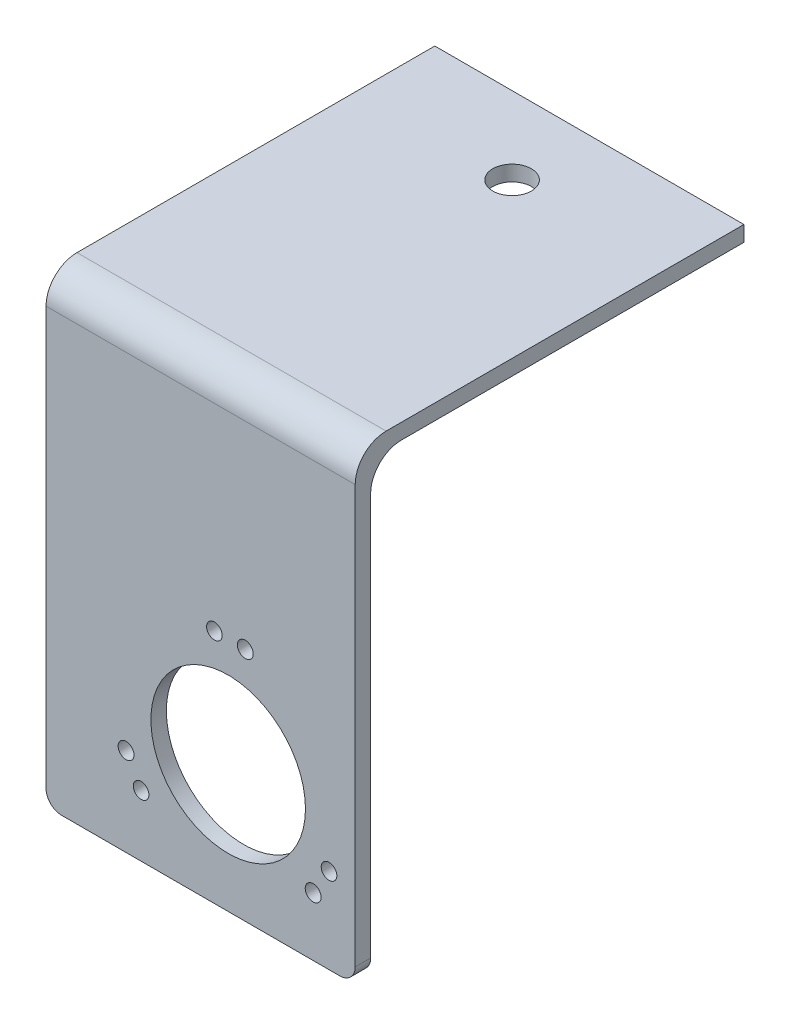
ISO-10303-21;
HEADER;
FILE_DESCRIPTION(('STEP AP214'),'2;1');
FILE_NAME('part.step','',(''),(''),'','','');
FILE_SCHEMA(('AUTOMOTIVE_DESIGN { 1 0 10303 214 1 1 1 1 }'));
ENDSEC;
DATA;
#1=APPLICATION_CONTEXT('core data for automotive mechanical design processes');
#2=APPLICATION_PROTOCOL_DEFINITION('international standard','automotive_design',2000,#1);
#3=PRODUCT_CONTEXT('',#1,'mechanical');
#4=PRODUCT('Part','Part','',(#3));
#5=PRODUCT_RELATED_PRODUCT_CATEGORY('part','',(#4));
#6=PRODUCT_DEFINITION_FORMATION('','',#4);
#7=PRODUCT_DEFINITION_CONTEXT('part definition',#1,'design');
#8=PRODUCT_DEFINITION('design','',#6,#7);
#9=PRODUCT_DEFINITION_SHAPE('','',#8);
#10=(LENGTH_UNIT() NAMED_UNIT(*) SI_UNIT(.MILLI.,.METRE.));
#11=(NAMED_UNIT(*) PLANE_ANGLE_UNIT() SI_UNIT($,.RADIAN.));
#12=(NAMED_UNIT(*) SI_UNIT($,.STERADIAN.) SOLID_ANGLE_UNIT());
#13=UNCERTAINTY_MEASURE_WITH_UNIT(LENGTH_MEASURE(1.E-05),#10,'distance_accuracy_value','');
#14=(GEOMETRIC_REPRESENTATION_CONTEXT(3) GLOBAL_UNCERTAINTY_ASSIGNED_CONTEXT((#13)) GLOBAL_UNIT_ASSIGNED_CONTEXT((#10,
#11,#12)) REPRESENTATION_CONTEXT('',''));
#15=CARTESIAN_POINT('',(0.,0.,0.));
#16=DIRECTION('',(0.,0.,1.));
#17=DIRECTION('',(1.,0.,0.));
#18=AXIS2_PLACEMENT_3D('',#15,#16,#17);
#19=CARTESIAN_POINT('',(0.,0.,0.));
#20=DIRECTION('',(0.,0.,-1.));
#21=DIRECTION('',(-1.,0.,0.));
#22=AXIS2_PLACEMENT_3D('',#19,#20,#21);
#23=PLANE('',#22);
#24=CARTESIAN_POINT('',(1.78254542280978,9.53727294800007,0.));
#25=DIRECTION('',(0.,0.,-1.));
#26=DIRECTION('',(-1.,0.,0.));
#27=AXIS2_PLACEMENT_3D('',#24,#25,#26);
#28=CIRCLE('',#27,1.00852213816915);
#29=CARTESIAN_POINT('',(0.774023284640623,9.53727294800007,0.));
#30=VERTEX_POINT('',#29);
#31=EDGE_CURVE('E152',#30,#30,#28,.F.);
#32=ORIENTED_EDGE('',*,*,#31,.T.);
#33=EDGE_LOOP('',(#32));
#34=FACE_BOUND('',#33,.T.);
#35=CARTESIAN_POINT('',(-9.64631487718463,-9.56766798786573,0.));
#36=DIRECTION('',(0.,0.,-1.));
#37=DIRECTION('',(-1.,0.,0.));
#38=AXIS2_PLACEMENT_3D('',#35,#36,#37);
#39=CIRCLE('',#38,1.02634430831698);
#40=CARTESIAN_POINT('',(-10.6726591855016,-9.56766798786573,0.));
#41=VERTEX_POINT('',#40);
#42=EDGE_CURVE('E188',#41,#41,#39,.F.);
#43=ORIENTED_EDGE('',*,*,#42,.T.);
#44=EDGE_LOOP('',(#43));
#45=FACE_BOUND('',#44,.T.);
#46=CARTESIAN_POINT('',(-7.70027141624171,-13.0623660932993,0.));
#47=DIRECTION('',(0.,0.,-1.));
#48=DIRECTION('',(-1.,0.,0.));
#49=AXIS2_PLACEMENT_3D('',#46,#47,#48);
#50=CIRCLE('',#49,1.00852213854465);
#51=CARTESIAN_POINT('',(-8.70879355478637,-13.0623660932993,0.));
#52=VERTEX_POINT('',#51);
#53=EDGE_CURVE('E184',#52,#52,#50,.F.);
#54=ORIENTED_EDGE('',*,*,#53,.T.);
#55=EDGE_LOOP('',(#54));
#56=FACE_BOUND('',#55,.T.);
#57=CARTESIAN_POINT('',(16.6129985294079,-9.97490685470309,0.));
#58=DIRECTION('',(0.,0.,-1.));
#59=DIRECTION('',(-1.,0.,0.));
#60=AXIS2_PLACEMENT_3D('',#57,#58,#59);
#61=CIRCLE('',#60,1.00852213859807);
#62=CARTESIAN_POINT('',(15.6044763908099,-9.97490685470309,0.));
#63=VERTEX_POINT('',#62);
#64=EDGE_CURVE('E187',#63,#63,#61,.F.);
#65=ORIENTED_EDGE('',*,*,#64,.T.);
#66=EDGE_LOOP('',(#65));
#67=FACE_BOUND('',#66,.T.);
#68=CARTESIAN_POINT('',(5.7820644911441,9.47524696932842,0.));
#69=DIRECTION('',(0.,0.,-1.));
#70=DIRECTION('',(-1.,0.,0.));
#71=AXIS2_PLACEMENT_3D('',#68,#69,#70);
#72=CIRCLE('',#71,1.02634430813729);
#73=CARTESIAN_POINT('',(4.75572018300681,9.47524696932842,0.));
#74=VERTEX_POINT('',#73);
#75=EDGE_CURVE('E196',#74,#74,#72,.F.);
#76=ORIENTED_EDGE('',*,*,#75,.T.);
#77=EDGE_LOOP('',(#76));
#78=FACE_BOUND('',#77,.T.);
#79=CARTESIAN_POINT('',(14.5595229220165,-13.407578981465,0.));
#80=DIRECTION('',(0.,0.,-1.));
#81=DIRECTION('',(-1.,0.,0.));
#82=AXIS2_PLACEMENT_3D('',#79,#80,#81);
#83=CIRCLE('',#82,1.02634430845716);
#84=CARTESIAN_POINT('',(13.5331786135594,-13.407578981465,0.));
#85=VERTEX_POINT('',#84);
#86=EDGE_CURVE('E180',#85,#85,#83,.F.);
#87=ORIENTED_EDGE('',*,*,#86,.T.);
#88=EDGE_LOOP('',(#87));
#89=FACE_BOUND('',#88,.T.);
#90=CARTESIAN_POINT('',(3.56509084532596,-4.5,0.));
#91=DIRECTION('',(0.,0.,-1.));
#92=DIRECTION('',(-1.,0.,0.));
#93=AXIS2_PLACEMENT_3D('',#90,#91,#92);
#94=CIRCLE('',#93,10.0000000001912);
#95=CARTESIAN_POINT('',(-6.43490915486527,-4.5,0.));
#96=VERTEX_POINT('',#95);
#97=EDGE_CURVE('E162',#96,#96,#94,.F.);
#98=ORIENTED_EDGE('',*,*,#97,.T.);
#99=EDGE_LOOP('',(#98));
#100=FACE_BOUND('',#99,.T.);
#101=DIRECTION('',(0.,-1.,0.));
#102=VECTOR('',#101,1.);
#103=CARTESIAN_POINT('',(-20.,-21.,0.));
#104=LINE('',#103,#102);
#105=CARTESIAN_POINT('',(-20.,33.05,0.));
#106=VERTEX_POINT('',#105);
#107=CARTESIAN_POINT('',(-20.,-19.,0.));
#108=VERTEX_POINT('',#107);
#109=EDGE_CURVE('E145',#106,#108,#104,.T.);
#110=ORIENTED_EDGE('',*,*,#109,.F.);
#111=DIRECTION('',(1.,0.,0.));
#112=VECTOR('',#111,1.);
#113=CARTESIAN_POINT('',(20.,33.05,0.));
#114=LINE('',#113,#112);
#115=CARTESIAN_POINT('',(20.,33.05,0.));
#116=VERTEX_POINT('',#115);
#117=EDGE_CURVE('E229',#106,#116,#114,.T.);
#118=ORIENTED_EDGE('',*,*,#117,.T.);
#119=DIRECTION('',(0.,1.,0.));
#120=VECTOR('',#119,1.);
#121=CARTESIAN_POINT('',(20.,-21.,0.));
#122=LINE('',#121,#120);
#123=CARTESIAN_POINT('',(20.,-19.,0.));
#124=VERTEX_POINT('',#123);
#125=EDGE_CURVE('E115',#124,#116,#122,.T.);
#126=ORIENTED_EDGE('',*,*,#125,.F.);
#127=CARTESIAN_POINT('',(18.,-19.,0.));
#128=DIRECTION('',(0.,0.,-1.));
#129=DIRECTION('',(-1.,0.,0.));
#130=AXIS2_PLACEMENT_3D('',#127,#128,#129);
#131=CIRCLE('',#130,2.);
#132=CARTESIAN_POINT('',(18.,-21.,0.));
#133=VERTEX_POINT('',#132);
#134=EDGE_CURVE('E159',#124,#133,#131,.T.);
#135=ORIENTED_EDGE('',*,*,#134,.T.);
#136=DIRECTION('',(1.,0.,0.));
#137=VECTOR('',#136,1.);
#138=CARTESIAN_POINT('',(-20.,-21.,0.));
#139=LINE('',#138,#137);
#140=CARTESIAN_POINT('',(-18.,-21.,0.));
#141=VERTEX_POINT('',#140);
#142=EDGE_CURVE('E144',#141,#133,#139,.T.);
#143=ORIENTED_EDGE('',*,*,#142,.F.);
#144=CARTESIAN_POINT('',(-18.,-19.,0.));
#145=DIRECTION('',(0.,0.,-1.));
#146=DIRECTION('',(-1.,0.,0.));
#147=AXIS2_PLACEMENT_3D('',#144,#145,#146);
#148=CIRCLE('',#147,2.);
#149=EDGE_CURVE('E161',#141,#108,#148,.T.);
#150=ORIENTED_EDGE('',*,*,#149,.T.);
#151=EDGE_LOOP('',(#110,#118,#126,#135,#143,#150));
#152=FACE_BOUND('',#151,.T.);
#153=ADVANCED_FACE('F33',(#34,#45,#56,#67,#78,#89,#100,#152),#23,.T.);
#154=CARTESIAN_POINT('',(20.,-21.,2.));
#155=DIRECTION('',(-1.,0.,0.));
#156=DIRECTION('',(0.,0.,1.));
#157=AXIS2_PLACEMENT_3D('',#154,#155,#156);
#158=PLANE('',#157);
#159=DIRECTION('',(0.,0.,-1.));
#160=VECTOR('',#159,1.);
#161=CARTESIAN_POINT('',(20.,39.05,-48.3));
#162=LINE('',#161,#160);
#163=CARTESIAN_POINT('',(20.,39.05,-2.));
#164=VERTEX_POINT('',#163);
#165=CARTESIAN_POINT('',(20.,39.05,-48.3));
#166=VERTEX_POINT('',#165);
#167=EDGE_CURVE('E217',#164,#166,#162,.T.);
#168=ORIENTED_EDGE('',*,*,#167,.F.);
#169=CARTESIAN_POINT('',(20.,35.05,-2.));
#170=DIRECTION('',(-1.,0.,0.));
#171=DIRECTION('',(0.,0.,1.));
#172=AXIS2_PLACEMENT_3D('',#169,#170,#171);
#173=CIRCLE('',#172,4.);
#174=CARTESIAN_POINT('',(20.,35.05,2.));
#175=VERTEX_POINT('',#174);
#176=EDGE_CURVE('E223',#164,#175,#173,.F.);
#177=ORIENTED_EDGE('',*,*,#176,.T.);
#178=DIRECTION('',(0.,1.,0.));
#179=VECTOR('',#178,1.);
#180=CARTESIAN_POINT('',(20.,-21.,2.));
#181=LINE('',#180,#179);
#182=CARTESIAN_POINT('',(20.,-19.,2.));
#183=VERTEX_POINT('',#182);
#184=EDGE_CURVE('E148',#183,#175,#181,.T.);
#185=ORIENTED_EDGE('',*,*,#184,.F.);
#186=DIRECTION('',(0.,0.,-1.));
#187=VECTOR('',#186,1.);
#188=CARTESIAN_POINT('',(20.,-19.,2.));
#189=LINE('',#188,#187);
#190=EDGE_CURVE('E166',#183,#124,#189,.T.);
#191=ORIENTED_EDGE('',*,*,#190,.T.);
#192=ORIENTED_EDGE('',*,*,#125,.T.);
#193=CARTESIAN_POINT('',(20.,33.05,-4.));
#194=DIRECTION('',(-1.,0.,0.));
#195=DIRECTION('',(0.,0.,1.));
#196=AXIS2_PLACEMENT_3D('',#193,#194,#195);
#197=CIRCLE('',#196,4.);
#198=CARTESIAN_POINT('',(20.,37.05,-4.));
#199=VERTEX_POINT('',#198);
#200=EDGE_CURVE('E41',#116,#199,#197,.T.);
#201=ORIENTED_EDGE('',*,*,#200,.T.);
#202=DIRECTION('',(0.,0.,-1.));
#203=VECTOR('',#202,1.);
#204=CARTESIAN_POINT('',(20.,37.05,0.));
#205=LINE('',#204,#203);
#206=CARTESIAN_POINT('',(20.,37.05,-48.3));
#207=VERTEX_POINT('',#206);
#208=EDGE_CURVE('E116',#199,#207,#205,.T.);
#209=ORIENTED_EDGE('',*,*,#208,.T.);
#210=DIRECTION('',(0.,-1.,0.));
#211=VECTOR('',#210,1.);
#212=CARTESIAN_POINT('',(20.,21.,-48.3));
#213=LINE('',#212,#211);
#214=EDGE_CURVE('E125',#166,#207,#213,.T.);
#215=ORIENTED_EDGE('',*,*,#214,.F.);
#216=EDGE_LOOP('',(#168,#177,#185,#191,#192,#201,#209,#215));
#217=FACE_BOUND('',#216,.T.);
#218=ADVANCED_FACE('F238',(#217),#158,.F.);
#219=CARTESIAN_POINT('',(-20.,-21.,2.));
#220=DIRECTION('',(1.,0.,0.));
#221=DIRECTION('',(0.,0.,-1.));
#222=AXIS2_PLACEMENT_3D('',#219,#220,#221);
#223=PLANE('',#222);
#224=DIRECTION('',(0.,-1.,0.));
#225=VECTOR('',#224,1.);
#226=CARTESIAN_POINT('',(-20.,-21.,2.));
#227=LINE('',#226,#225);
#228=CARTESIAN_POINT('',(-20.,35.05,2.));
#229=VERTEX_POINT('',#228);
#230=CARTESIAN_POINT('',(-20.,-19.,2.));
#231=VERTEX_POINT('',#230);
#232=EDGE_CURVE('E153',#229,#231,#227,.T.);
#233=ORIENTED_EDGE('',*,*,#232,.F.);
#234=CARTESIAN_POINT('',(-20.,35.05,-2.));
#235=DIRECTION('',(1.,0.,0.));
#236=DIRECTION('',(0.,0.,-1.));
#237=AXIS2_PLACEMENT_3D('',#234,#235,#236);
#238=CIRCLE('',#237,4.);
#239=CARTESIAN_POINT('',(-20.,39.05,-2.));
#240=VERTEX_POINT('',#239);
#241=EDGE_CURVE('E227',#229,#240,#238,.F.);
#242=ORIENTED_EDGE('',*,*,#241,.T.);
#243=DIRECTION('',(0.,0.,1.));
#244=VECTOR('',#243,1.);
#245=CARTESIAN_POINT('',(-20.,39.05,-48.3));
#246=LINE('',#245,#244);
#247=CARTESIAN_POINT('',(-20.,39.05,-48.3));
#248=VERTEX_POINT('',#247);
#249=EDGE_CURVE('E131',#248,#240,#246,.T.);
#250=ORIENTED_EDGE('',*,*,#249,.F.);
#251=DIRECTION('',(0.,1.,0.));
#252=VECTOR('',#251,1.);
#253=CARTESIAN_POINT('',(-20.,21.,-48.3));
#254=LINE('',#253,#252);
#255=CARTESIAN_POINT('',(-20.,37.05,-48.3));
#256=VERTEX_POINT('',#255);
#257=EDGE_CURVE('E122',#256,#248,#254,.T.);
#258=ORIENTED_EDGE('',*,*,#257,.F.);
#259=DIRECTION('',(0.,0.,-1.));
#260=VECTOR('',#259,1.);
#261=CARTESIAN_POINT('',(-20.,37.05,0.));
#262=LINE('',#261,#260);
#263=CARTESIAN_POINT('',(-20.,37.05,-4.));
#264=VERTEX_POINT('',#263);
#265=EDGE_CURVE('E106',#264,#256,#262,.T.);
#266=ORIENTED_EDGE('',*,*,#265,.F.);
#267=CARTESIAN_POINT('',(-20.,33.05,-4.));
#268=DIRECTION('',(1.,0.,0.));
#269=DIRECTION('',(0.,0.,-1.));
#270=AXIS2_PLACEMENT_3D('',#267,#268,#269);
#271=CIRCLE('',#270,4.);
#272=EDGE_CURVE('E11',#264,#106,#271,.T.);
#273=ORIENTED_EDGE('',*,*,#272,.T.);
#274=ORIENTED_EDGE('',*,*,#109,.T.);
#275=DIRECTION('',(0.,0.,-1.));
#276=VECTOR('',#275,1.);
#277=CARTESIAN_POINT('',(-20.,-19.,2.));
#278=LINE('',#277,#276);
#279=EDGE_CURVE('E141',#108,#231,#278,.F.);
#280=ORIENTED_EDGE('',*,*,#279,.T.);
#281=EDGE_LOOP('',(#233,#242,#250,#258,#266,#273,#274,#280));
#282=FACE_BOUND('',#281,.T.);
#283=ADVANCED_FACE('F129',(#282),#223,.F.);
#284=CARTESIAN_POINT('',(-20.,-21.,2.));
#285=DIRECTION('',(0.,1.,0.));
#286=DIRECTION('',(0.,0.,1.));
#287=AXIS2_PLACEMENT_3D('',#284,#285,#286);
#288=PLANE('',#287);
#289=ORIENTED_EDGE('',*,*,#142,.T.);
#290=DIRECTION('',(0.,0.,-1.));
#291=VECTOR('',#290,1.);
#292=CARTESIAN_POINT('',(18.,-21.,2.));
#293=LINE('',#292,#291);
#294=CARTESIAN_POINT('',(18.,-21.,2.));
#295=VERTEX_POINT('',#294);
#296=EDGE_CURVE('E154',#133,#295,#293,.F.);
#297=ORIENTED_EDGE('',*,*,#296,.T.);
#298=DIRECTION('',(1.,0.,0.));
#299=VECTOR('',#298,1.);
#300=CARTESIAN_POINT('',(-20.,-21.,2.));
#301=LINE('',#300,#299);
#302=CARTESIAN_POINT('',(-18.,-21.,2.));
#303=VERTEX_POINT('',#302);
#304=EDGE_CURVE('E149',#303,#295,#301,.T.);
#305=ORIENTED_EDGE('',*,*,#304,.F.);
#306=DIRECTION('',(0.,0.,-1.));
#307=VECTOR('',#306,1.);
#308=CARTESIAN_POINT('',(-18.,-21.,2.));
#309=LINE('',#308,#307);
#310=EDGE_CURVE('E156',#303,#141,#309,.T.);
#311=ORIENTED_EDGE('',*,*,#310,.T.);
#312=EDGE_LOOP('',(#289,#297,#305,#311));
#313=FACE_BOUND('',#312,.T.);
#314=ADVANCED_FACE('F247',(#313),#288,.F.);
#315=CARTESIAN_POINT('',(0.,0.,2.));
#316=DIRECTION('',(0.,0.,-1.));
#317=DIRECTION('',(-1.,0.,0.));
#318=AXIS2_PLACEMENT_3D('',#315,#316,#317);
#319=PLANE('',#318);
#320=CARTESIAN_POINT('',(1.78254542280978,9.53727294800007,2.));
#321=DIRECTION('',(0.,0.,1.));
#322=DIRECTION('',(1.,0.,0.));
#323=AXIS2_PLACEMENT_3D('',#320,#321,#322);
#324=CIRCLE('',#323,1.00852213816915);
#325=CARTESIAN_POINT('',(2.79106756097893,9.53727294800007,2.));
#326=VERTEX_POINT('',#325);
#327=EDGE_CURVE('E202',#326,#326,#324,.T.);
#328=ORIENTED_EDGE('',*,*,#327,.F.);
#329=EDGE_LOOP('',(#328));
#330=FACE_BOUND('',#329,.T.);
#331=CARTESIAN_POINT('',(-9.64631487718463,-9.56766798786573,2.));
#332=DIRECTION('',(0.,0.,1.));
#333=DIRECTION('',(1.,0.,0.));
#334=AXIS2_PLACEMENT_3D('',#331,#332,#333);
#335=CIRCLE('',#334,1.02634430831698);
#336=CARTESIAN_POINT('',(-8.61997056886764,-9.56766798786573,2.));
#337=VERTEX_POINT('',#336);
#338=EDGE_CURVE('E192',#337,#337,#335,.T.);
#339=ORIENTED_EDGE('',*,*,#338,.F.);
#340=EDGE_LOOP('',(#339));
#341=FACE_BOUND('',#340,.T.);
#342=CARTESIAN_POINT('',(-7.70027141624171,-13.0623660932993,2.));
#343=DIRECTION('',(0.,0.,1.));
#344=DIRECTION('',(1.,0.,0.));
#345=AXIS2_PLACEMENT_3D('',#342,#343,#344);
#346=CIRCLE('',#345,1.00852213854465);
#347=CARTESIAN_POINT('',(-6.69174927769706,-13.0623660932993,2.));
#348=VERTEX_POINT('',#347);
#349=EDGE_CURVE('E189',#348,#348,#346,.T.);
#350=ORIENTED_EDGE('',*,*,#349,.F.);
#351=EDGE_LOOP('',(#350));
#352=FACE_BOUND('',#351,.T.);
#353=CARTESIAN_POINT('',(16.6129985294079,-9.97490685470309,2.));
#354=DIRECTION('',(0.,0.,1.));
#355=DIRECTION('',(1.,0.,0.));
#356=AXIS2_PLACEMENT_3D('',#353,#354,#355);
#357=CIRCLE('',#356,1.00852213859807);
#358=CARTESIAN_POINT('',(17.621520668006,-9.97490685470309,2.));
#359=VERTEX_POINT('',#358);
#360=EDGE_CURVE('E193',#359,#359,#357,.T.);
#361=ORIENTED_EDGE('',*,*,#360,.F.);
#362=EDGE_LOOP('',(#361));
#363=FACE_BOUND('',#362,.T.);
#364=CARTESIAN_POINT('',(5.7820644911441,9.47524696932842,2.));
#365=DIRECTION('',(0.,0.,1.));
#366=DIRECTION('',(1.,0.,0.));
#367=AXIS2_PLACEMENT_3D('',#364,#365,#366);
#368=CIRCLE('',#367,1.02634430813729);
#369=CARTESIAN_POINT('',(6.80840879928138,9.47524696932842,2.));
#370=VERTEX_POINT('',#369);
#371=EDGE_CURVE('E199',#370,#370,#368,.T.);
#372=ORIENTED_EDGE('',*,*,#371,.F.);
#373=EDGE_LOOP('',(#372));
#374=FACE_BOUND('',#373,.T.);
#375=CARTESIAN_POINT('',(14.5595229220165,-13.407578981465,2.));
#376=DIRECTION('',(0.,0.,1.));
#377=DIRECTION('',(1.,0.,0.));
#378=AXIS2_PLACEMENT_3D('',#375,#376,#377);
#379=CIRCLE('',#378,1.02634430845716);
#380=CARTESIAN_POINT('',(15.5858672304737,-13.407578981465,2.));
#381=VERTEX_POINT('',#380);
#382=EDGE_CURVE('E183',#381,#381,#379,.T.);
#383=ORIENTED_EDGE('',*,*,#382,.F.);
#384=EDGE_LOOP('',(#383));
#385=FACE_BOUND('',#384,.T.);
#386=CARTESIAN_POINT('',(3.56509084532596,-4.5,2.));
#387=DIRECTION('',(0.,0.,1.));
#388=DIRECTION('',(1.,0.,0.));
#389=AXIS2_PLACEMENT_3D('',#386,#387,#388);
#390=CIRCLE('',#389,10.0000000001912);
#391=CARTESIAN_POINT('',(13.5650908455172,-4.5,2.));
#392=VERTEX_POINT('',#391);
#393=EDGE_CURVE('E165',#392,#392,#390,.T.);
#394=ORIENTED_EDGE('',*,*,#393,.F.);
#395=EDGE_LOOP('',(#394));
#396=FACE_BOUND('',#395,.T.);
#397=ORIENTED_EDGE('',*,*,#184,.T.);
#398=DIRECTION('',(1.,0.,0.));
#399=VECTOR('',#398,1.);
#400=CARTESIAN_POINT('',(-20.,35.05,2.));
#401=LINE('',#400,#399);
#402=EDGE_CURVE('E225',#175,#229,#401,.F.);
#403=ORIENTED_EDGE('',*,*,#402,.T.);
#404=ORIENTED_EDGE('',*,*,#232,.T.);
#405=CARTESIAN_POINT('',(-18.,-19.,2.));
#406=DIRECTION('',(0.,0.,-1.));
#407=DIRECTION('',(-1.,0.,0.));
#408=AXIS2_PLACEMENT_3D('',#405,#406,#407);
#409=CIRCLE('',#408,2.);
#410=EDGE_CURVE('E150',#231,#303,#409,.F.);
#411=ORIENTED_EDGE('',*,*,#410,.T.);
#412=ORIENTED_EDGE('',*,*,#304,.T.);
#413=CARTESIAN_POINT('',(18.,-19.,2.));
#414=DIRECTION('',(0.,0.,-1.));
#415=DIRECTION('',(-1.,0.,0.));
#416=AXIS2_PLACEMENT_3D('',#413,#414,#415);
#417=CIRCLE('',#416,2.);
#418=EDGE_CURVE('E146',#295,#183,#417,.F.);
#419=ORIENTED_EDGE('',*,*,#418,.T.);
#420=EDGE_LOOP('',(#397,#403,#404,#411,#412,#419));
#421=FACE_BOUND('',#420,.T.);
#422=ADVANCED_FACE('F272',(#330,#341,#352,#363,#374,#385,#396,#421),#319,.F.);
#423=CARTESIAN_POINT('',(18.,-19.,2.));
#424=DIRECTION('',(0.,0.,-1.));
#425=DIRECTION('',(-1.,0.,0.));
#426=AXIS2_PLACEMENT_3D('',#423,#424,#425);
#427=CYLINDRICAL_SURFACE('',#426,2.);
#428=ORIENTED_EDGE('',*,*,#418,.F.);
#429=ORIENTED_EDGE('',*,*,#296,.F.);
#430=ORIENTED_EDGE('',*,*,#134,.F.);
#431=ORIENTED_EDGE('',*,*,#190,.F.);
#432=EDGE_LOOP('',(#428,#429,#430,#431));
#433=FACE_BOUND('',#432,.T.);
#434=ADVANCED_FACE('F243',(#433),#427,.T.);
#435=CARTESIAN_POINT('',(-18.,-19.,2.));
#436=DIRECTION('',(0.,0.,-1.));
#437=DIRECTION('',(-1.,0.,0.));
#438=AXIS2_PLACEMENT_3D('',#435,#436,#437);
#439=CYLINDRICAL_SURFACE('',#438,2.);
#440=ORIENTED_EDGE('',*,*,#410,.F.);
#441=ORIENTED_EDGE('',*,*,#279,.F.);
#442=ORIENTED_EDGE('',*,*,#149,.F.);
#443=ORIENTED_EDGE('',*,*,#310,.F.);
#444=EDGE_LOOP('',(#440,#441,#442,#443));
#445=FACE_BOUND('',#444,.T.);
#446=ADVANCED_FACE('F252',(#445),#439,.T.);
#447=CARTESIAN_POINT('',(3.56509084532596,-4.5,-48.301));
#448=DIRECTION('',(0.,0.,1.));
#449=DIRECTION('',(1.,0.,0.));
#450=AXIS2_PLACEMENT_3D('',#447,#448,#449);
#451=CYLINDRICAL_SURFACE('',#450,10.0000000001912);
#452=ORIENTED_EDGE('',*,*,#97,.F.);
#453=EDGE_LOOP('',(#452));
#454=FACE_BOUND('',#453,.T.);
#455=ORIENTED_EDGE('',*,*,#393,.T.);
#456=EDGE_LOOP('',(#455));
#457=FACE_BOUND('',#456,.T.);
#458=ADVANCED_FACE('F276',(#454,#457),#451,.F.);
#459=CARTESIAN_POINT('',(14.5595229220165,-13.407578981465,-48.301));
#460=DIRECTION('',(0.,0.,1.));
#461=DIRECTION('',(1.,0.,0.));
#462=AXIS2_PLACEMENT_3D('',#459,#460,#461);
#463=CYLINDRICAL_SURFACE('',#462,1.02634430845716);
#464=ORIENTED_EDGE('',*,*,#86,.F.);
#465=EDGE_LOOP('',(#464));
#466=FACE_BOUND('',#465,.T.);
#467=ORIENTED_EDGE('',*,*,#382,.T.);
#468=EDGE_LOOP('',(#467));
#469=FACE_BOUND('',#468,.T.);
#470=ADVANCED_FACE('F279',(#466,#469),#463,.F.);
#471=CARTESIAN_POINT('',(5.7820644911441,9.47524696932842,-48.301));
#472=DIRECTION('',(0.,0.,1.));
#473=DIRECTION('',(1.,0.,0.));
#474=AXIS2_PLACEMENT_3D('',#471,#472,#473);
#475=CYLINDRICAL_SURFACE('',#474,1.02634430813729);
#476=ORIENTED_EDGE('',*,*,#75,.F.);
#477=EDGE_LOOP('',(#476));
#478=FACE_BOUND('',#477,.T.);
#479=ORIENTED_EDGE('',*,*,#371,.T.);
#480=EDGE_LOOP('',(#479));
#481=FACE_BOUND('',#480,.T.);
#482=ADVANCED_FACE('F289',(#478,#481),#475,.F.);
#483=CARTESIAN_POINT('',(16.6129985294079,-9.97490685470309,-48.301));
#484=DIRECTION('',(0.,0.,1.));
#485=DIRECTION('',(1.,0.,0.));
#486=AXIS2_PLACEMENT_3D('',#483,#484,#485);
#487=CYLINDRICAL_SURFACE('',#486,1.00852213859807);
#488=ORIENTED_EDGE('',*,*,#64,.F.);
#489=EDGE_LOOP('',(#488));
#490=FACE_BOUND('',#489,.T.);
#491=ORIENTED_EDGE('',*,*,#360,.T.);
#492=EDGE_LOOP('',(#491));
#493=FACE_BOUND('',#492,.T.);
#494=ADVANCED_FACE('F285',(#490,#493),#487,.F.);
#495=CARTESIAN_POINT('',(-7.70027141624171,-13.0623660932993,-48.301));
#496=DIRECTION('',(0.,0.,1.));
#497=DIRECTION('',(1.,0.,0.));
#498=AXIS2_PLACEMENT_3D('',#495,#496,#497);
#499=CYLINDRICAL_SURFACE('',#498,1.00852213854465);
#500=ORIENTED_EDGE('',*,*,#53,.F.);
#501=EDGE_LOOP('',(#500));
#502=FACE_BOUND('',#501,.T.);
#503=ORIENTED_EDGE('',*,*,#349,.T.);
#504=EDGE_LOOP('',(#503));
#505=FACE_BOUND('',#504,.T.);
#506=ADVANCED_FACE('F281',(#502,#505),#499,.F.);
#507=CARTESIAN_POINT('',(-9.64631487718463,-9.56766798786573,-48.301));
#508=DIRECTION('',(0.,0.,1.));
#509=DIRECTION('',(1.,0.,0.));
#510=AXIS2_PLACEMENT_3D('',#507,#508,#509);
#511=CYLINDRICAL_SURFACE('',#510,1.02634430831698);
#512=ORIENTED_EDGE('',*,*,#42,.F.);
#513=EDGE_LOOP('',(#512));
#514=FACE_BOUND('',#513,.T.);
#515=ORIENTED_EDGE('',*,*,#338,.T.);
#516=EDGE_LOOP('',(#515));
#517=FACE_BOUND('',#516,.T.);
#518=ADVANCED_FACE('F284',(#514,#517),#511,.F.);
#519=CARTESIAN_POINT('',(1.78254542280978,9.53727294800007,-48.301));
#520=DIRECTION('',(0.,0.,1.));
#521=DIRECTION('',(1.,0.,0.));
#522=AXIS2_PLACEMENT_3D('',#519,#520,#521);
#523=CYLINDRICAL_SURFACE('',#522,1.00852213816915);
#524=ORIENTED_EDGE('',*,*,#31,.F.);
#525=EDGE_LOOP('',(#524));
#526=FACE_BOUND('',#525,.T.);
#527=ORIENTED_EDGE('',*,*,#327,.T.);
#528=EDGE_LOOP('',(#527));
#529=FACE_BOUND('',#528,.T.);
#530=ADVANCED_FACE('F291',(#526,#529),#523,.F.);
#531=CARTESIAN_POINT('',(0.,39.05,0.));
#532=DIRECTION('',(0.,1.,0.));
#533=DIRECTION('',(0.,0.,1.));
#534=AXIS2_PLACEMENT_3D('',#531,#532,#533);
#535=PLANE('',#534);
#536=ORIENTED_EDGE('',*,*,#249,.T.);
#537=DIRECTION('',(1.,0.,0.));
#538=VECTOR('',#537,1.);
#539=CARTESIAN_POINT('',(20.,39.05,-2.));
#540=LINE('',#539,#538);
#541=EDGE_CURVE('E219',#240,#164,#540,.T.);
#542=ORIENTED_EDGE('',*,*,#541,.T.);
#543=ORIENTED_EDGE('',*,*,#167,.T.);
#544=DIRECTION('',(-1.,0.,0.));
#545=VECTOR('',#544,1.);
#546=CARTESIAN_POINT('',(-20.,39.05,-48.3));
#547=LINE('',#546,#545);
#548=EDGE_CURVE('E134',#166,#248,#547,.T.);
#549=ORIENTED_EDGE('',*,*,#548,.T.);
#550=EDGE_LOOP('',(#536,#542,#543,#549));
#551=FACE_BOUND('',#550,.T.);
#552=CARTESIAN_POINT('',(0.,39.05,-38.3));
#553=DIRECTION('',(0.,1.,0.));
#554=DIRECTION('',(0.,0.,1.));
#555=AXIS2_PLACEMENT_3D('',#552,#553,#554);
#556=CIRCLE('',#555,2.5);
#557=CARTESIAN_POINT('',(0.,39.05,-35.8));
#558=VERTEX_POINT('',#557);
#559=EDGE_CURVE('E139',#558,#558,#556,.T.);
#560=ORIENTED_EDGE('',*,*,#559,.F.);
#561=EDGE_LOOP('',(#560));
#562=FACE_BOUND('',#561,.T.);
#563=ADVANCED_FACE('F294',(#551,#562),#535,.T.);
#564=CARTESIAN_POINT('',(-20.,37.05,0.));
#565=DIRECTION('',(0.,-1.,0.));
#566=DIRECTION('',(0.,0.,-1.));
#567=AXIS2_PLACEMENT_3D('',#564,#565,#566);
#568=PLANE('',#567);
#569=ORIENTED_EDGE('',*,*,#208,.F.);
#570=DIRECTION('',(1.,0.,0.));
#571=VECTOR('',#570,1.);
#572=CARTESIAN_POINT('',(-20.,37.05,-4.));
#573=LINE('',#572,#571);
#574=EDGE_CURVE('E48',#199,#264,#573,.F.);
#575=ORIENTED_EDGE('',*,*,#574,.T.);
#576=ORIENTED_EDGE('',*,*,#265,.T.);
#577=DIRECTION('',(1.,0.,0.));
#578=VECTOR('',#577,1.);
#579=CARTESIAN_POINT('',(-20.,37.05,-48.3));
#580=LINE('',#579,#578);
#581=EDGE_CURVE('E110',#256,#207,#580,.T.);
#582=ORIENTED_EDGE('',*,*,#581,.T.);
#583=EDGE_LOOP('',(#569,#575,#576,#582));
#584=FACE_BOUND('',#583,.T.);
#585=CARTESIAN_POINT('',(0.,37.05,-38.3));
#586=DIRECTION('',(0.,-1.,0.));
#587=DIRECTION('',(0.,0.,-1.));
#588=AXIS2_PLACEMENT_3D('',#585,#586,#587);
#589=CIRCLE('',#588,2.5);
#590=CARTESIAN_POINT('',(0.,37.05,-40.8));
#591=VERTEX_POINT('',#590);
#592=EDGE_CURVE('E126',#591,#591,#589,.F.);
#593=ORIENTED_EDGE('',*,*,#592,.T.);
#594=EDGE_LOOP('',(#593));
#595=FACE_BOUND('',#594,.T.);
#596=ADVANCED_FACE('F108',(#584,#595),#568,.T.);
#597=CARTESIAN_POINT('',(0.,21.001,-38.3));
#598=DIRECTION('',(0.,-1.,0.));
#599=DIRECTION('',(0.,0.,-1.));
#600=AXIS2_PLACEMENT_3D('',#597,#598,#599);
#601=CYLINDRICAL_SURFACE('',#600,2.5);
#602=ORIENTED_EDGE('',*,*,#559,.T.);
#603=EDGE_LOOP('',(#602));
#604=FACE_BOUND('',#603,.T.);
#605=ORIENTED_EDGE('',*,*,#592,.F.);
#606=EDGE_LOOP('',(#605));
#607=FACE_BOUND('',#606,.T.);
#608=ADVANCED_FACE('F370',(#604,#607),#601,.F.);
#609=CARTESIAN_POINT('',(0.,0.,-48.3));
#610=DIRECTION('',(0.,0.,-1.));
#611=DIRECTION('',(-1.,0.,0.));
#612=AXIS2_PLACEMENT_3D('',#609,#610,#611);
#613=PLANE('',#612);
#614=ORIENTED_EDGE('',*,*,#214,.T.);
#615=ORIENTED_EDGE('',*,*,#581,.F.);
#616=ORIENTED_EDGE('',*,*,#257,.T.);
#617=ORIENTED_EDGE('',*,*,#548,.F.);
#618=EDGE_LOOP('',(#614,#615,#616,#617));
#619=FACE_BOUND('',#618,.T.);
#620=ADVANCED_FACE('F120',(#619),#613,.T.);
#621=CARTESIAN_POINT('',(0.,35.05,-2.));
#622=DIRECTION('',(-1.,0.,0.));
#623=DIRECTION('',(0.,0.,1.));
#624=AXIS2_PLACEMENT_3D('',#621,#622,#623);
#625=CYLINDRICAL_SURFACE('',#624,4.);
#626=ORIENTED_EDGE('',*,*,#241,.F.);
#627=ORIENTED_EDGE('',*,*,#402,.F.);
#628=ORIENTED_EDGE('',*,*,#176,.F.);
#629=ORIENTED_EDGE('',*,*,#541,.F.);
#630=EDGE_LOOP('',(#626,#627,#628,#629));
#631=FACE_BOUND('',#630,.T.);
#632=ADVANCED_FACE('F256',(#631),#625,.T.);
#633=CARTESIAN_POINT('',(0.,33.05,-4.));
#634=DIRECTION('',(-1.,0.,0.));
#635=DIRECTION('',(0.,0.,1.));
#636=AXIS2_PLACEMENT_3D('',#633,#634,#635);
#637=CYLINDRICAL_SURFACE('',#636,4.);
#638=ORIENTED_EDGE('',*,*,#272,.F.);
#639=ORIENTED_EDGE('',*,*,#574,.F.);
#640=ORIENTED_EDGE('',*,*,#200,.F.);
#641=ORIENTED_EDGE('',*,*,#117,.F.);
#642=EDGE_LOOP('',(#638,#639,#640,#641));
#643=FACE_BOUND('',#642,.T.);
#644=ADVANCED_FACE('F35',(#643),#637,.F.);
#645=CLOSED_SHELL('',(#153,#218,#283,#314,#422,#434,#446,#458,#470,#482,#494,#506,#518,#530,
#563,#596,#608,#620,#632,#644));
#646=MANIFOLD_SOLID_BREP('B2',#645);
#647=ADVANCED_BREP_SHAPE_REPRESENTATION('',(#18,#646),#14);
#648=SHAPE_DEFINITION_REPRESENTATION(#9,#647);
ENDSEC;
END-ISO-10303-21;
